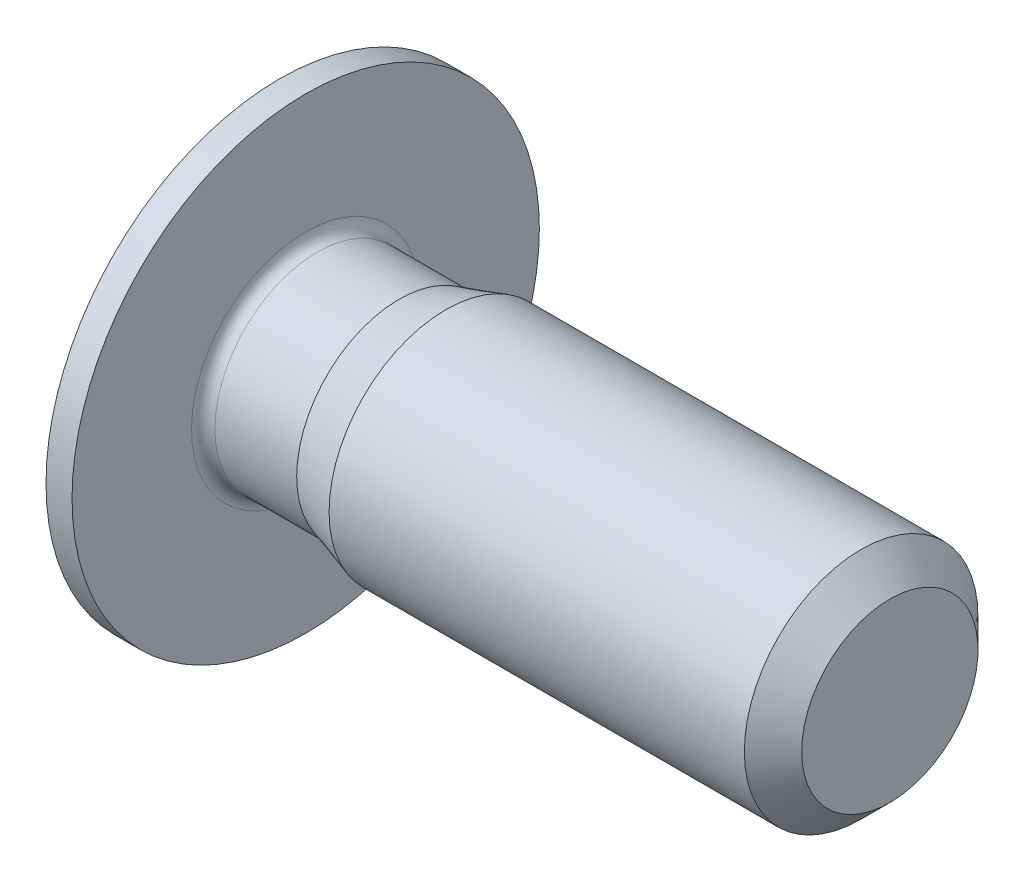
ISO-10303-21;
HEADER;
FILE_DESCRIPTION(('STEP AP214'),'2;1');
FILE_NAME('part.step','',(''),(''),'','','');
FILE_SCHEMA(('AUTOMOTIVE_DESIGN { 1 0 10303 214 1 1 1 1 }'));
ENDSEC;
DATA;
#1=APPLICATION_CONTEXT('core data for automotive mechanical design processes');
#2=APPLICATION_PROTOCOL_DEFINITION('international standard','automotive_design',2000,#1);
#3=PRODUCT_CONTEXT('',#1,'mechanical');
#4=PRODUCT('Part','Part','',(#3));
#5=PRODUCT_RELATED_PRODUCT_CATEGORY('part','',(#4));
#6=PRODUCT_DEFINITION_FORMATION('','',#4);
#7=PRODUCT_DEFINITION_CONTEXT('part definition',#1,'design');
#8=PRODUCT_DEFINITION('design','',#6,#7);
#9=PRODUCT_DEFINITION_SHAPE('','',#8);
#10=(LENGTH_UNIT() NAMED_UNIT(*) SI_UNIT(.MILLI.,.METRE.));
#11=(NAMED_UNIT(*) PLANE_ANGLE_UNIT() SI_UNIT($,.RADIAN.));
#12=(NAMED_UNIT(*) SI_UNIT($,.STERADIAN.) SOLID_ANGLE_UNIT());
#13=UNCERTAINTY_MEASURE_WITH_UNIT(LENGTH_MEASURE(1.E-05),#10,'distance_accuracy_value','');
#14=(GEOMETRIC_REPRESENTATION_CONTEXT(3) GLOBAL_UNCERTAINTY_ASSIGNED_CONTEXT((#13)) GLOBAL_UNIT_ASSIGNED_CONTEXT((#10,
#11,#12)) REPRESENTATION_CONTEXT('',''));
#15=CARTESIAN_POINT('',(0.,0.,0.));
#16=DIRECTION('',(0.,0.,1.));
#17=DIRECTION('',(1.,0.,0.));
#18=AXIS2_PLACEMENT_3D('',#15,#16,#17);
#19=CARTESIAN_POINT('',(-0.5,0.,0.));
#20=DIRECTION('',(1.,0.,0.));
#21=DIRECTION('',(0.,0.,-1.));
#22=AXIS2_PLACEMENT_3D('',#19,#20,#21);
#23=PLANE('',#22);
#24=CARTESIAN_POINT('',(-0.5,0.,0.));
#25=DIRECTION('',(-1.,0.,0.));
#26=DIRECTION('',(0.,0.,1.));
#27=AXIS2_PLACEMENT_3D('',#24,#25,#26);
#28=CIRCLE('',#27,1.52);
#29=CARTESIAN_POINT('',(-0.5,0.,1.52));
#30=VERTEX_POINT('',#29);
#31=EDGE_CURVE('E145',#30,#30,#28,.T.);
#32=ORIENTED_EDGE('',*,*,#31,.T.);
#33=EDGE_LOOP('',(#32));
#34=FACE_BOUND('',#33,.T.);
#35=DIRECTION('',(0.,0.499999999999993,-0.866025403784442));
#36=VECTOR('',#35,1.);
#37=CARTESIAN_POINT('',(-0.5,-0.75055534994651,0.));
#38=LINE('',#37,#36);
#39=CARTESIAN_POINT('',(-0.5,-0.75055534994651,0.));
#40=VERTEX_POINT('',#39);
#41=CARTESIAN_POINT('',(-0.5,-0.37527767497326,-0.65));
#42=VERTEX_POINT('',#41);
#43=EDGE_CURVE('E413',#40,#42,#38,.T.);
#44=ORIENTED_EDGE('',*,*,#43,.T.);
#45=DIRECTION('',(0.,1.,0.));
#46=VECTOR('',#45,1.);
#47=CARTESIAN_POINT('',(-0.5,-0.37527767497326,-0.65));
#48=LINE('',#47,#46);
#49=CARTESIAN_POINT('',(-0.5,0.37527767497326,-0.65));
#50=VERTEX_POINT('',#49);
#51=EDGE_CURVE('E415',#42,#50,#48,.T.);
#52=ORIENTED_EDGE('',*,*,#51,.T.);
#53=DIRECTION('',(0.,0.499999999999993,0.866025403784442));
#54=VECTOR('',#53,1.);
#55=CARTESIAN_POINT('',(-0.5,0.37527767497326,-0.65));
#56=LINE('',#55,#54);
#57=CARTESIAN_POINT('',(-0.5,0.75055534994651,0.));
#58=VERTEX_POINT('',#57);
#59=EDGE_CURVE('E417',#50,#58,#56,.T.);
#60=ORIENTED_EDGE('',*,*,#59,.T.);
#61=DIRECTION('',(0.,-0.499999999999993,0.866025403784442));
#62=VECTOR('',#61,1.);
#63=CARTESIAN_POINT('',(-0.5,0.75055534994651,0.));
#64=LINE('',#63,#62);
#65=CARTESIAN_POINT('',(-0.5,0.37527767497326,0.65));
#66=VERTEX_POINT('',#65);
#67=EDGE_CURVE('E119',#58,#66,#64,.T.);
#68=ORIENTED_EDGE('',*,*,#67,.T.);
#69=DIRECTION('',(0.,-1.,0.));
#70=VECTOR('',#69,1.);
#71=CARTESIAN_POINT('',(-0.5,0.37527767497326,0.65));
#72=LINE('',#71,#70);
#73=CARTESIAN_POINT('',(-0.5,-0.37527767497326,0.65));
#74=VERTEX_POINT('',#73);
#75=EDGE_CURVE('E410',#66,#74,#72,.T.);
#76=ORIENTED_EDGE('',*,*,#75,.T.);
#77=DIRECTION('',(0.,-0.499999999999993,-0.866025403784442));
#78=VECTOR('',#77,1.);
#79=CARTESIAN_POINT('',(-0.5,-0.37527767497326,0.65));
#80=LINE('',#79,#78);
#81=EDGE_CURVE('E134',#74,#40,#80,.T.);
#82=ORIENTED_EDGE('',*,*,#81,.T.);
#83=EDGE_LOOP('',(#44,#52,#60,#68,#76,#82));
#84=FACE_BOUND('',#83,.T.);
#85=ADVANCED_FACE('F35',(#34,#84),#23,.F.);
#86=CARTESIAN_POINT('',(5.,0.7545,0.));
#87=DIRECTION('',(-1.,0.,0.));
#88=DIRECTION('',(0.,0.,1.));
#89=AXIS2_PLACEMENT_3D('',#86,#87,#88);
#90=PLANE('',#89);
#91=CARTESIAN_POINT('',(5.,0.,0.));
#92=DIRECTION('',(-1.,0.,0.));
#93=DIRECTION('',(0.,0.,1.));
#94=AXIS2_PLACEMENT_3D('',#91,#92,#93);
#95=CIRCLE('',#94,0.7545);
#96=CARTESIAN_POINT('',(5.,0.,0.7545));
#97=VERTEX_POINT('',#96);
#98=EDGE_CURVE('E11',#97,#97,#95,.T.);
#99=ORIENTED_EDGE('',*,*,#98,.F.);
#100=EDGE_LOOP('',(#99));
#101=FACE_BOUND('',#100,.T.);
#102=ADVANCED_FACE('F37',(#101),#90,.F.);
#103=CARTESIAN_POINT('',(5.,0.,0.));
#104=DIRECTION('',(-1.,0.,0.));
#105=DIRECTION('',(0.,0.,1.));
#106=AXIS2_PLACEMENT_3D('',#103,#104,#105);
#107=CONICAL_SURFACE('',#106,0.7545,0.785398163397448);
#108=CARTESIAN_POINT('',(4.7545,0.,0.));
#109=DIRECTION('',(-1.,0.,0.));
#110=DIRECTION('',(0.,0.,1.));
#111=AXIS2_PLACEMENT_3D('',#108,#109,#110);
#112=CIRCLE('',#111,1.);
#113=CARTESIAN_POINT('',(4.7545,0.,1.));
#114=VERTEX_POINT('',#113);
#115=EDGE_CURVE('E43',#114,#114,#112,.T.);
#116=ORIENTED_EDGE('',*,*,#115,.F.);
#117=EDGE_LOOP('',(#116));
#118=FACE_BOUND('',#117,.T.);
#119=ORIENTED_EDGE('',*,*,#98,.T.);
#120=EDGE_LOOP('',(#119));
#121=FACE_BOUND('',#120,.T.);
#122=ADVANCED_FACE('F171',(#118,#121),#107,.T.);
#123=CARTESIAN_POINT('',(5.,0.,0.));
#124=DIRECTION('',(-1.,0.,0.));
#125=DIRECTION('',(0.,0.,1.));
#126=AXIS2_PLACEMENT_3D('',#123,#124,#125);
#127=CYLINDRICAL_SURFACE('',#126,1.);
#128=CARTESIAN_POINT('',(1.2,0.,0.));
#129=DIRECTION('',(-1.,0.,0.));
#130=DIRECTION('',(0.,0.,1.));
#131=AXIS2_PLACEMENT_3D('',#128,#129,#130);
#132=CIRCLE('',#131,1.);
#133=CARTESIAN_POINT('',(1.2,0.,1.));
#134=VERTEX_POINT('',#133);
#135=EDGE_CURVE('E164',#134,#134,#132,.T.);
#136=ORIENTED_EDGE('',*,*,#135,.F.);
#137=EDGE_LOOP('',(#136));
#138=FACE_BOUND('',#137,.T.);
#139=ORIENTED_EDGE('',*,*,#115,.T.);
#140=EDGE_LOOP('',(#139));
#141=FACE_BOUND('',#140,.T.);
#142=ADVANCED_FACE('F169',(#138,#141),#127,.T.);
#143=CARTESIAN_POINT('',(1.2,0.,0.));
#144=DIRECTION('',(1.,0.,0.));
#145=DIRECTION('',(0.,0.,-1.));
#146=AXIS2_PLACEMENT_3D('',#143,#144,#145);
#147=CONICAL_SURFACE('',#146,1.,0.297752138542791);
#148=CARTESIAN_POINT('',(0.8,0.,0.));
#149=DIRECTION('',(-1.,0.,0.));
#150=DIRECTION('',(0.,0.,1.));
#151=AXIS2_PLACEMENT_3D('',#148,#149,#150);
#152=CIRCLE('',#151,0.87725);
#153=CARTESIAN_POINT('',(0.8,0.,0.87725));
#154=VERTEX_POINT('',#153);
#155=EDGE_CURVE('E161',#154,#154,#152,.T.);
#156=ORIENTED_EDGE('',*,*,#155,.F.);
#157=EDGE_LOOP('',(#156));
#158=FACE_BOUND('',#157,.T.);
#159=ORIENTED_EDGE('',*,*,#135,.T.);
#160=EDGE_LOOP('',(#159));
#161=FACE_BOUND('',#160,.T.);
#162=ADVANCED_FACE('F208',(#158,#161),#147,.T.);
#163=CARTESIAN_POINT('',(5.,0.,0.));
#164=DIRECTION('',(-1.,0.,0.));
#165=DIRECTION('',(0.,0.,1.));
#166=AXIS2_PLACEMENT_3D('',#163,#164,#165);
#167=CYLINDRICAL_SURFACE('',#166,0.87725);
#168=CARTESIAN_POINT('',(0.1,0.,0.));
#169=DIRECTION('',(-1.,0.,0.));
#170=DIRECTION('',(0.,0.,1.));
#171=AXIS2_PLACEMENT_3D('',#168,#169,#170);
#172=CIRCLE('',#171,0.87725);
#173=CARTESIAN_POINT('',(0.1,0.,0.87725));
#174=VERTEX_POINT('',#173);
#175=EDGE_CURVE('E158',#174,#174,#172,.T.);
#176=ORIENTED_EDGE('',*,*,#175,.F.);
#177=EDGE_LOOP('',(#176));
#178=FACE_BOUND('',#177,.T.);
#179=ORIENTED_EDGE('',*,*,#155,.T.);
#180=EDGE_LOOP('',(#179));
#181=FACE_BOUND('',#180,.T.);
#182=ADVANCED_FACE('F204',(#178,#181),#167,.T.);
#183=CARTESIAN_POINT('',(0.0999999999999906,0.,0.));
#184=DIRECTION('',(-1.,0.,0.));
#185=DIRECTION('',(0.,0.,1.));
#186=AXIS2_PLACEMENT_3D('',#183,#184,#185);
#187=TOROIDAL_SURFACE('',#186,0.977249999999991,0.0999999999999907);
#188=CARTESIAN_POINT('',(0.,0.,0.));
#189=DIRECTION('',(-1.,0.,0.));
#190=DIRECTION('',(0.,0.,1.));
#191=AXIS2_PLACEMENT_3D('',#188,#189,#190);
#192=CIRCLE('',#191,0.97725);
#193=CARTESIAN_POINT('',(0.,0.,0.97725));
#194=VERTEX_POINT('',#193);
#195=EDGE_CURVE('E155',#194,#194,#192,.T.);
#196=ORIENTED_EDGE('',*,*,#195,.F.);
#197=EDGE_LOOP('',(#196));
#198=FACE_BOUND('',#197,.T.);
#199=ORIENTED_EDGE('',*,*,#175,.T.);
#200=EDGE_LOOP('',(#199));
#201=FACE_BOUND('',#200,.T.);
#202=ADVANCED_FACE('F200',(#198,#201),#187,.F.);
#203=CARTESIAN_POINT('',(0.,2.,0.));
#204=DIRECTION('',(-1.,0.,0.));
#205=DIRECTION('',(0.,0.,1.));
#206=AXIS2_PLACEMENT_3D('',#203,#204,#205);
#207=PLANE('',#206);
#208=CARTESIAN_POINT('',(0.,0.,0.));
#209=DIRECTION('',(-1.,0.,0.));
#210=DIRECTION('',(0.,0.,1.));
#211=AXIS2_PLACEMENT_3D('',#208,#209,#210);
#212=CIRCLE('',#211,2.);
#213=CARTESIAN_POINT('',(0.,0.,2.));
#214=VERTEX_POINT('',#213);
#215=EDGE_CURVE('E152',#214,#214,#212,.T.);
#216=ORIENTED_EDGE('',*,*,#215,.F.);
#217=EDGE_LOOP('',(#216));
#218=FACE_BOUND('',#217,.T.);
#219=ORIENTED_EDGE('',*,*,#195,.T.);
#220=EDGE_LOOP('',(#219));
#221=FACE_BOUND('',#220,.T.);
#222=ADVANCED_FACE('F196',(#218,#221),#207,.F.);
#223=CARTESIAN_POINT('',(5.,0.,0.));
#224=DIRECTION('',(-1.,0.,0.));
#225=DIRECTION('',(0.,0.,1.));
#226=AXIS2_PLACEMENT_3D('',#223,#224,#225);
#227=CYLINDRICAL_SURFACE('',#226,2.);
#228=CARTESIAN_POINT('',(-0.22287187078898,0.,0.));
#229=DIRECTION('',(-1.,0.,0.));
#230=DIRECTION('',(0.,0.,1.));
#231=AXIS2_PLACEMENT_3D('',#228,#229,#230);
#232=CIRCLE('',#231,2.);
#233=CARTESIAN_POINT('',(-0.22287187078898,0.,2.));
#234=VERTEX_POINT('',#233);
#235=EDGE_CURVE('E149',#234,#234,#232,.T.);
#236=ORIENTED_EDGE('',*,*,#235,.F.);
#237=EDGE_LOOP('',(#236));
#238=FACE_BOUND('',#237,.T.);
#239=ORIENTED_EDGE('',*,*,#215,.T.);
#240=EDGE_LOOP('',(#239));
#241=FACE_BOUND('',#240,.T.);
#242=ADVANCED_FACE('F192',(#238,#241),#227,.T.);
#243=CARTESIAN_POINT('',(-0.22287187078898,0.,0.));
#244=DIRECTION('',(1.,0.,0.));
#245=DIRECTION('',(0.,0.,-1.));
#246=AXIS2_PLACEMENT_3D('',#243,#244,#245);
#247=CONICAL_SURFACE('',#246,2.,1.0471975511966);
#248=ORIENTED_EDGE('',*,*,#31,.F.);
#249=EDGE_LOOP('',(#248));
#250=FACE_BOUND('',#249,.T.);
#251=ORIENTED_EDGE('',*,*,#235,.T.);
#252=EDGE_LOOP('',(#251));
#253=FACE_BOUND('',#252,.T.);
#254=ADVANCED_FACE('F189',(#250,#253),#247,.T.);
#255=CARTESIAN_POINT('',(0.7,0.37527767497326,0.65));
#256=DIRECTION('',(0.,0.,-1.));
#257=DIRECTION('',(-1.,0.,0.));
#258=AXIS2_PLACEMENT_3D('',#255,#256,#257);
#259=PLANE('',#258);
#260=DIRECTION('',(0.,-1.,0.));
#261=VECTOR('',#260,1.);
#262=CARTESIAN_POINT('',(0.7,0.37527767497326,0.65));
#263=LINE('',#262,#261);
#264=CARTESIAN_POINT('',(0.7,0.37527767497326,0.65));
#265=VERTEX_POINT('',#264);
#266=CARTESIAN_POINT('',(0.7,0.,0.65));
#267=VERTEX_POINT('',#266);
#268=EDGE_CURVE('E116',#265,#267,#263,.T.);
#269=ORIENTED_EDGE('',*,*,#268,.T.);
#270=CARTESIAN_POINT('',(0.7,-0.37527767497326,0.65));
#271=VERTEX_POINT('',#270);
#272=EDGE_CURVE('E108',#267,#271,#263,.T.);
#273=ORIENTED_EDGE('',*,*,#272,.T.);
#274=DIRECTION('',(-1.,0.,0.));
#275=VECTOR('',#274,1.);
#276=CARTESIAN_POINT('',(0.7,-0.37527767497326,0.65));
#277=LINE('',#276,#275);
#278=EDGE_CURVE('E113',#271,#74,#277,.T.);
#279=ORIENTED_EDGE('',*,*,#278,.T.);
#280=ORIENTED_EDGE('',*,*,#75,.F.);
#281=DIRECTION('',(-1.,0.,0.));
#282=VECTOR('',#281,1.);
#283=CARTESIAN_POINT('',(0.7,0.37527767497326,0.65));
#284=LINE('',#283,#282);
#285=EDGE_CURVE('E405',#265,#66,#284,.T.);
#286=ORIENTED_EDGE('',*,*,#285,.F.);
#287=EDGE_LOOP('',(#269,#273,#279,#280,#286));
#288=FACE_BOUND('',#287,.T.);
#289=ADVANCED_FACE('F110',(#288),#259,.T.);
#290=CARTESIAN_POINT('',(0.7,-0.37527767497326,0.65));
#291=DIRECTION('',(0.,0.866025403784443,-0.499999999999993));
#292=DIRECTION('',(0.,0.499999999999993,0.866025403784442));
#293=AXIS2_PLACEMENT_3D('',#290,#291,#292);
#294=PLANE('',#293);
#295=DIRECTION('',(0.,-0.499999999999993,-0.866025403784442));
#296=VECTOR('',#295,1.);
#297=CARTESIAN_POINT('',(0.7,-0.37527767497326,0.65));
#298=LINE('',#297,#296);
#299=CARTESIAN_POINT('',(0.7,-0.562916512459887,0.324999999999996));
#300=VERTEX_POINT('',#299);
#301=EDGE_CURVE('E122',#271,#300,#298,.T.);
#302=ORIENTED_EDGE('',*,*,#301,.T.);
#303=CARTESIAN_POINT('',(0.7,-0.75055534994651,0.));
#304=VERTEX_POINT('',#303);
#305=EDGE_CURVE('E129',#300,#304,#298,.T.);
#306=ORIENTED_EDGE('',*,*,#305,.T.);
#307=DIRECTION('',(-1.,0.,0.));
#308=VECTOR('',#307,1.);
#309=CARTESIAN_POINT('',(0.7,-0.75055534994651,0.));
#310=LINE('',#309,#308);
#311=EDGE_CURVE('E135',#304,#40,#310,.T.);
#312=ORIENTED_EDGE('',*,*,#311,.T.);
#313=ORIENTED_EDGE('',*,*,#81,.F.);
#314=ORIENTED_EDGE('',*,*,#278,.F.);
#315=EDGE_LOOP('',(#302,#306,#312,#313,#314));
#316=FACE_BOUND('',#315,.T.);
#317=ADVANCED_FACE('F132',(#316),#294,.T.);
#318=CARTESIAN_POINT('',(0.7,-0.75055534994651,0.));
#319=DIRECTION('',(0.,0.866025403784443,0.499999999999993));
#320=DIRECTION('',(0.,-0.499999999999993,0.866025403784442));
#321=AXIS2_PLACEMENT_3D('',#318,#319,#320);
#322=PLANE('',#321);
#323=DIRECTION('',(0.,0.499999999999993,-0.866025403784442));
#324=VECTOR('',#323,1.);
#325=CARTESIAN_POINT('',(0.7,-0.75055534994651,0.));
#326=LINE('',#325,#324);
#327=CARTESIAN_POINT('',(0.7,-0.562916512459879,-0.324999999999991));
#328=VERTEX_POINT('',#327);
#329=EDGE_CURVE('E50',#304,#328,#326,.T.);
#330=ORIENTED_EDGE('',*,*,#329,.T.);
#331=CARTESIAN_POINT('',(0.7,-0.37527767497326,-0.65));
#332=VERTEX_POINT('',#331);
#333=EDGE_CURVE('E128',#328,#332,#326,.T.);
#334=ORIENTED_EDGE('',*,*,#333,.T.);
#335=DIRECTION('',(-1.,0.,0.));
#336=VECTOR('',#335,1.);
#337=CARTESIAN_POINT('',(0.7,-0.37527767497326,-0.65));
#338=LINE('',#337,#336);
#339=EDGE_CURVE('E140',#332,#42,#338,.T.);
#340=ORIENTED_EDGE('',*,*,#339,.T.);
#341=ORIENTED_EDGE('',*,*,#43,.F.);
#342=ORIENTED_EDGE('',*,*,#311,.F.);
#343=EDGE_LOOP('',(#330,#334,#340,#341,#342));
#344=FACE_BOUND('',#343,.T.);
#345=ADVANCED_FACE('F256',(#344),#322,.T.);
#346=CARTESIAN_POINT('',(0.7,-0.37527767497326,-0.65));
#347=DIRECTION('',(0.,0.,1.));
#348=DIRECTION('',(1.,0.,0.));
#349=AXIS2_PLACEMENT_3D('',#346,#347,#348);
#350=PLANE('',#349);
#351=DIRECTION('',(0.,1.,0.));
#352=VECTOR('',#351,1.);
#353=CARTESIAN_POINT('',(0.7,-0.37527767497326,-0.65));
#354=LINE('',#353,#352);
#355=CARTESIAN_POINT('',(0.7,0.,-0.65));
#356=VERTEX_POINT('',#355);
#357=EDGE_CURVE('E435',#332,#356,#354,.T.);
#358=ORIENTED_EDGE('',*,*,#357,.T.);
#359=CARTESIAN_POINT('',(0.7,0.37527767497326,-0.65));
#360=VERTEX_POINT('',#359);
#361=EDGE_CURVE('E433',#356,#360,#354,.T.);
#362=ORIENTED_EDGE('',*,*,#361,.T.);
#363=DIRECTION('',(-1.,0.,0.));
#364=VECTOR('',#363,1.);
#365=CARTESIAN_POINT('',(0.7,0.37527767497326,-0.65));
#366=LINE('',#365,#364);
#367=EDGE_CURVE('E421',#360,#50,#366,.T.);
#368=ORIENTED_EDGE('',*,*,#367,.T.);
#369=ORIENTED_EDGE('',*,*,#51,.F.);
#370=ORIENTED_EDGE('',*,*,#339,.F.);
#371=EDGE_LOOP('',(#358,#362,#368,#369,#370));
#372=FACE_BOUND('',#371,.T.);
#373=ADVANCED_FACE('F263',(#372),#350,.T.);
#374=CARTESIAN_POINT('',(0.7,0.37527767497326,-0.65));
#375=DIRECTION('',(0.,-0.866025403784443,0.499999999999993));
#376=DIRECTION('',(0.,-0.499999999999993,-0.866025403784442));
#377=AXIS2_PLACEMENT_3D('',#374,#375,#376);
#378=PLANE('',#377);
#379=DIRECTION('',(0.,0.499999999999993,0.866025403784442));
#380=VECTOR('',#379,1.);
#381=CARTESIAN_POINT('',(0.7,0.37527767497326,-0.65));
#382=LINE('',#381,#380);
#383=CARTESIAN_POINT('',(0.7,0.562916512459887,-0.324999999999996));
#384=VERTEX_POINT('',#383);
#385=EDGE_CURVE('E397',#360,#384,#382,.T.);
#386=ORIENTED_EDGE('',*,*,#385,.T.);
#387=CARTESIAN_POINT('',(0.7,0.75055534994651,0.));
#388=VERTEX_POINT('',#387);
#389=EDGE_CURVE('E436',#384,#388,#382,.T.);
#390=ORIENTED_EDGE('',*,*,#389,.T.);
#391=DIRECTION('',(-1.,0.,0.));
#392=VECTOR('',#391,1.);
#393=CARTESIAN_POINT('',(0.7,0.75055534994651,0.));
#394=LINE('',#393,#392);
#395=EDGE_CURVE('E403',#388,#58,#394,.T.);
#396=ORIENTED_EDGE('',*,*,#395,.T.);
#397=ORIENTED_EDGE('',*,*,#59,.F.);
#398=ORIENTED_EDGE('',*,*,#367,.F.);
#399=EDGE_LOOP('',(#386,#390,#396,#397,#398));
#400=FACE_BOUND('',#399,.T.);
#401=ADVANCED_FACE('F270',(#400),#378,.T.);
#402=CARTESIAN_POINT('',(0.7,0.75055534994651,0.));
#403=DIRECTION('',(0.,-0.866025403784443,-0.499999999999993));
#404=DIRECTION('',(0.,0.499999999999993,-0.866025403784442));
#405=AXIS2_PLACEMENT_3D('',#402,#403,#404);
#406=PLANE('',#405);
#407=DIRECTION('',(0.,-0.499999999999993,0.866025403784442));
#408=VECTOR('',#407,1.);
#409=CARTESIAN_POINT('',(0.7,0.75055534994651,0.));
#410=LINE('',#409,#408);
#411=CARTESIAN_POINT('',(0.7,0.562916512459887,0.324999999999996));
#412=VERTEX_POINT('',#411);
#413=EDGE_CURVE('E396',#388,#412,#410,.T.);
#414=ORIENTED_EDGE('',*,*,#413,.T.);
#415=EDGE_CURVE('E393',#412,#265,#410,.T.);
#416=ORIENTED_EDGE('',*,*,#415,.T.);
#417=ORIENTED_EDGE('',*,*,#285,.T.);
#418=ORIENTED_EDGE('',*,*,#67,.F.);
#419=ORIENTED_EDGE('',*,*,#395,.F.);
#420=EDGE_LOOP('',(#414,#416,#417,#418,#419));
#421=FACE_BOUND('',#420,.T.);
#422=ADVANCED_FACE('F278',(#421),#406,.T.);
#423=CARTESIAN_POINT('',(0.7,0.,0.));
#424=DIRECTION('',(1.,0.,0.));
#425=DIRECTION('',(0.,0.,-1.));
#426=AXIS2_PLACEMENT_3D('',#423,#424,#425);
#427=PLANE('',#426);
#428=CARTESIAN_POINT('',(0.7,0.,0.));
#429=DIRECTION('',(-1.,0.,0.));
#430=DIRECTION('',(0.,0.,1.));
#431=AXIS2_PLACEMENT_3D('',#428,#429,#430);
#432=CIRCLE('',#431,0.64999999999999);
#433=EDGE_CURVE('E440',#384,#356,#432,.T.);
#434=ORIENTED_EDGE('',*,*,#433,.F.);
#435=ORIENTED_EDGE('',*,*,#385,.F.);
#436=ORIENTED_EDGE('',*,*,#361,.F.);
#437=EDGE_LOOP('',(#434,#435,#436));
#438=FACE_BOUND('',#437,.T.);
#439=ADVANCED_FACE('F286',(#438),#427,.F.);
#440=EDGE_CURVE('E146',#412,#384,#432,.T.);
#441=ORIENTED_EDGE('',*,*,#440,.F.);
#442=ORIENTED_EDGE('',*,*,#413,.F.);
#443=ORIENTED_EDGE('',*,*,#389,.F.);
#444=EDGE_LOOP('',(#441,#442,#443));
#445=FACE_BOUND('',#444,.T.);
#446=ADVANCED_FACE('F294',(#445),#427,.F.);
#447=EDGE_CURVE('E139',#267,#412,#432,.T.);
#448=ORIENTED_EDGE('',*,*,#447,.F.);
#449=ORIENTED_EDGE('',*,*,#268,.F.);
#450=ORIENTED_EDGE('',*,*,#415,.F.);
#451=EDGE_LOOP('',(#448,#449,#450));
#452=FACE_BOUND('',#451,.T.);
#453=ADVANCED_FACE('F303',(#452),#427,.F.);
#454=EDGE_CURVE('E124',#300,#267,#432,.T.);
#455=ORIENTED_EDGE('',*,*,#454,.F.);
#456=ORIENTED_EDGE('',*,*,#301,.F.);
#457=ORIENTED_EDGE('',*,*,#272,.F.);
#458=EDGE_LOOP('',(#455,#456,#457));
#459=FACE_BOUND('',#458,.T.);
#460=ADVANCED_FACE('F123',(#459),#427,.F.);
#461=EDGE_CURVE('E137',#328,#300,#432,.T.);
#462=ORIENTED_EDGE('',*,*,#461,.F.);
#463=ORIENTED_EDGE('',*,*,#329,.F.);
#464=ORIENTED_EDGE('',*,*,#305,.F.);
#465=EDGE_LOOP('',(#462,#463,#464));
#466=FACE_BOUND('',#465,.T.);
#467=ADVANCED_FACE('F316',(#466),#427,.F.);
#468=EDGE_CURVE('E441',#356,#328,#432,.T.);
#469=ORIENTED_EDGE('',*,*,#468,.F.);
#470=ORIENTED_EDGE('',*,*,#357,.F.);
#471=ORIENTED_EDGE('',*,*,#333,.F.);
#472=EDGE_LOOP('',(#469,#470,#471));
#473=FACE_BOUND('',#472,.T.);
#474=ADVANCED_FACE('F297',(#473),#427,.F.);
#475=CARTESIAN_POINT('',(1.0752776749733,0.,0.));
#476=DIRECTION('',(-1.,0.,0.));
#477=DIRECTION('',(0.,0.,1.));
#478=AXIS2_PLACEMENT_3D('',#475,#476,#477);
#479=CONICAL_SURFACE('',#478,0.,1.04719755119654);
#480=ORIENTED_EDGE('',*,*,#447,.T.);
#481=ORIENTED_EDGE('',*,*,#440,.T.);
#482=ORIENTED_EDGE('',*,*,#433,.T.);
#483=ORIENTED_EDGE('',*,*,#468,.T.);
#484=ORIENTED_EDGE('',*,*,#461,.T.);
#485=ORIENTED_EDGE('',*,*,#454,.T.);
#486=EDGE_LOOP('',(#480,#481,#482,#483,#484,#485));
#487=FACE_BOUND('',#486,.T.);
#488=CARTESIAN_POINT('',(1.0752776749733,0.,0.));
#489=VERTEX_POINT('',#488);
#490=VERTEX_LOOP('',#489);
#491=FACE_BOUND('',#490,.T.);
#492=ADVANCED_FACE('F187',(#487,#491),#479,.F.);
#493=CLOSED_SHELL('',(#85,#102,#122,#142,#162,#182,#202,#222,#242,#254,#289,#317,#345,#373,#401,
#422,#439,#446,#453,#460,#467,#474,#492));
#494=MANIFOLD_SOLID_BREP('B2',#493);
#495=ADVANCED_BREP_SHAPE_REPRESENTATION('',(#18,#494),#14);
#496=SHAPE_DEFINITION_REPRESENTATION(#9,#495);
ENDSEC;
END-ISO-10303-21;
